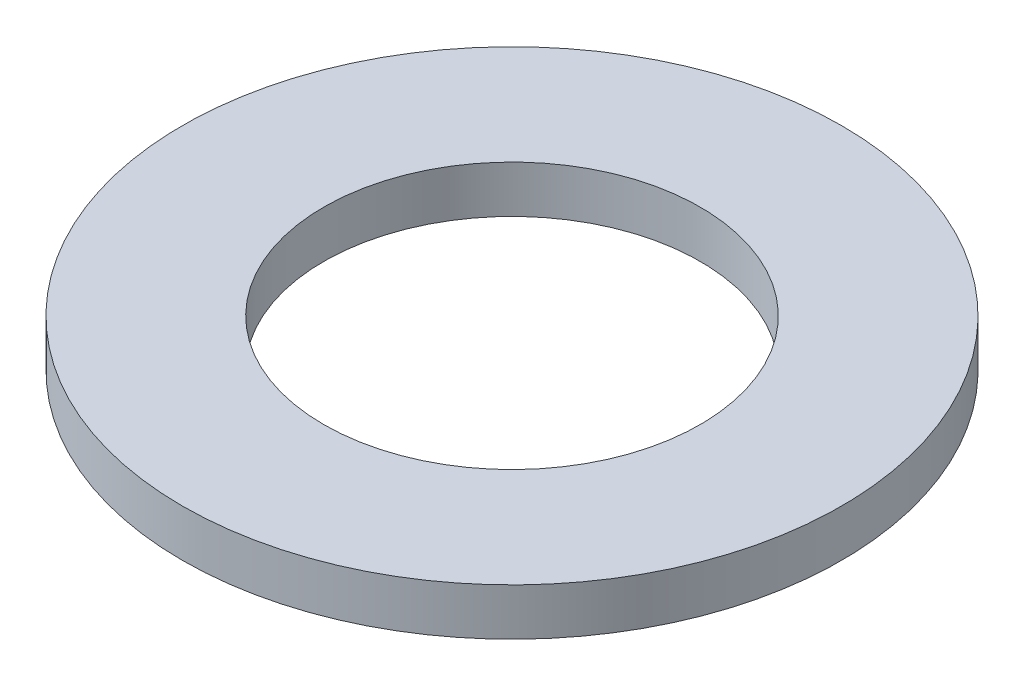
ISO-10303-21;
HEADER;
FILE_DESCRIPTION(('STEP AP214'),'2;1');
FILE_NAME('part.step','',(''),(''),'','','');
FILE_SCHEMA(('AUTOMOTIVE_DESIGN { 1 0 10303 214 1 1 1 1 }'));
ENDSEC;
DATA;
#1=APPLICATION_CONTEXT('core data for automotive mechanical design processes');
#2=APPLICATION_PROTOCOL_DEFINITION('international standard','automotive_design',2000,#1);
#3=PRODUCT_CONTEXT('',#1,'mechanical');
#4=PRODUCT('Part','Part','',(#3));
#5=PRODUCT_RELATED_PRODUCT_CATEGORY('part','',(#4));
#6=PRODUCT_DEFINITION_FORMATION('','',#4);
#7=PRODUCT_DEFINITION_CONTEXT('part definition',#1,'design');
#8=PRODUCT_DEFINITION('design','',#6,#7);
#9=PRODUCT_DEFINITION_SHAPE('','',#8);
#10=(LENGTH_UNIT() NAMED_UNIT(*) SI_UNIT(.MILLI.,.METRE.));
#11=(NAMED_UNIT(*) PLANE_ANGLE_UNIT() SI_UNIT($,.RADIAN.));
#12=(NAMED_UNIT(*) SI_UNIT($,.STERADIAN.) SOLID_ANGLE_UNIT());
#13=UNCERTAINTY_MEASURE_WITH_UNIT(LENGTH_MEASURE(1.E-05),#10,'distance_accuracy_value','');
#14=(GEOMETRIC_REPRESENTATION_CONTEXT(3) GLOBAL_UNCERTAINTY_ASSIGNED_CONTEXT((#13)) GLOBAL_UNIT_ASSIGNED_CONTEXT((#10,
#11,#12)) REPRESENTATION_CONTEXT('',''));
#15=CARTESIAN_POINT('',(0.,0.,0.));
#16=DIRECTION('',(0.,0.,1.));
#17=DIRECTION('',(1.,0.,0.));
#18=AXIS2_PLACEMENT_3D('',#15,#16,#17);
#19=CARTESIAN_POINT('',(0.,1.5875,0.));
#20=DIRECTION('',(0.,1.,0.));
#21=DIRECTION('',(0.,0.,1.));
#22=AXIS2_PLACEMENT_3D('',#19,#20,#21);
#23=PLANE('',#22);
#24=CARTESIAN_POINT('',(0.,1.5875,0.));
#25=DIRECTION('',(0.,1.,0.));
#26=DIRECTION('',(0.,0.,1.));
#27=AXIS2_PLACEMENT_3D('',#24,#25,#26);
#28=CIRCLE('',#27,11.1125);
#29=CARTESIAN_POINT('',(0.,1.5875,11.1125));
#30=VERTEX_POINT('',#29);
#31=EDGE_CURVE('E10',#30,#30,#28,.T.);
#32=ORIENTED_EDGE('',*,*,#31,.T.);
#33=EDGE_LOOP('',(#32));
#34=FACE_BOUND('',#33,.T.);
#35=CARTESIAN_POINT('',(0.,1.5875,0.));
#36=DIRECTION('',(0.,1.,0.));
#37=DIRECTION('',(0.,0.,1.));
#38=AXIS2_PLACEMENT_3D('',#35,#36,#37);
#39=CIRCLE('',#38,6.35);
#40=CARTESIAN_POINT('',(0.,1.5875,6.35));
#41=VERTEX_POINT('',#40);
#42=EDGE_CURVE('E41',#41,#41,#39,.T.);
#43=ORIENTED_EDGE('',*,*,#42,.F.);
#44=EDGE_LOOP('',(#43));
#45=FACE_BOUND('',#44,.T.);
#46=ADVANCED_FACE('F30',(#34,#45),#23,.T.);
#47=CARTESIAN_POINT('',(0.,0.,0.));
#48=DIRECTION('',(0.,1.,0.));
#49=DIRECTION('',(0.,0.,1.));
#50=AXIS2_PLACEMENT_3D('',#47,#48,#49);
#51=PLANE('',#50);
#52=CARTESIAN_POINT('',(0.,0.,0.));
#53=DIRECTION('',(0.,1.,0.));
#54=DIRECTION('',(0.,0.,1.));
#55=AXIS2_PLACEMENT_3D('',#52,#53,#54);
#56=CIRCLE('',#55,11.1125);
#57=CARTESIAN_POINT('',(0.,0.,11.1125));
#58=VERTEX_POINT('',#57);
#59=EDGE_CURVE('E34',#58,#58,#56,.T.);
#60=ORIENTED_EDGE('',*,*,#59,.F.);
#61=EDGE_LOOP('',(#60));
#62=FACE_BOUND('',#61,.T.);
#63=CARTESIAN_POINT('',(0.,0.,0.));
#64=DIRECTION('',(0.,1.,0.));
#65=DIRECTION('',(0.,0.,1.));
#66=AXIS2_PLACEMENT_3D('',#63,#64,#65);
#67=CIRCLE('',#66,6.35);
#68=CARTESIAN_POINT('',(0.,0.,6.35));
#69=VERTEX_POINT('',#68);
#70=EDGE_CURVE('E43',#69,#69,#67,.T.);
#71=ORIENTED_EDGE('',*,*,#70,.T.);
#72=EDGE_LOOP('',(#71));
#73=FACE_BOUND('',#72,.T.);
#74=ADVANCED_FACE('F53',(#62,#73),#51,.F.);
#75=CARTESIAN_POINT('',(0.,1.5875,0.));
#76=DIRECTION('',(0.,-1.,0.));
#77=DIRECTION('',(0.,0.,-1.));
#78=AXIS2_PLACEMENT_3D('',#75,#76,#77);
#79=CYLINDRICAL_SURFACE('',#78,11.1125);
#80=ORIENTED_EDGE('',*,*,#31,.F.);
#81=EDGE_LOOP('',(#80));
#82=FACE_BOUND('',#81,.T.);
#83=ORIENTED_EDGE('',*,*,#59,.T.);
#84=EDGE_LOOP('',(#83));
#85=FACE_BOUND('',#84,.T.);
#86=ADVANCED_FACE('F32',(#82,#85),#79,.T.);
#87=CARTESIAN_POINT('',(0.,1.5875,0.));
#88=DIRECTION('',(0.,-1.,0.));
#89=DIRECTION('',(0.,0.,-1.));
#90=AXIS2_PLACEMENT_3D('',#87,#88,#89);
#91=CYLINDRICAL_SURFACE('',#90,6.35);
#92=ORIENTED_EDGE('',*,*,#42,.T.);
#93=EDGE_LOOP('',(#92));
#94=FACE_BOUND('',#93,.T.);
#95=ORIENTED_EDGE('',*,*,#70,.F.);
#96=EDGE_LOOP('',(#95));
#97=FACE_BOUND('',#96,.T.);
#98=ADVANCED_FACE('F49',(#94,#97),#91,.F.);
#99=CLOSED_SHELL('',(#46,#74,#86,#98));
#100=MANIFOLD_SOLID_BREP('B2',#99);
#101=ADVANCED_BREP_SHAPE_REPRESENTATION('',(#18,#100),#14);
#102=SHAPE_DEFINITION_REPRESENTATION(#9,#101);
ENDSEC;
END-ISO-10303-21;
